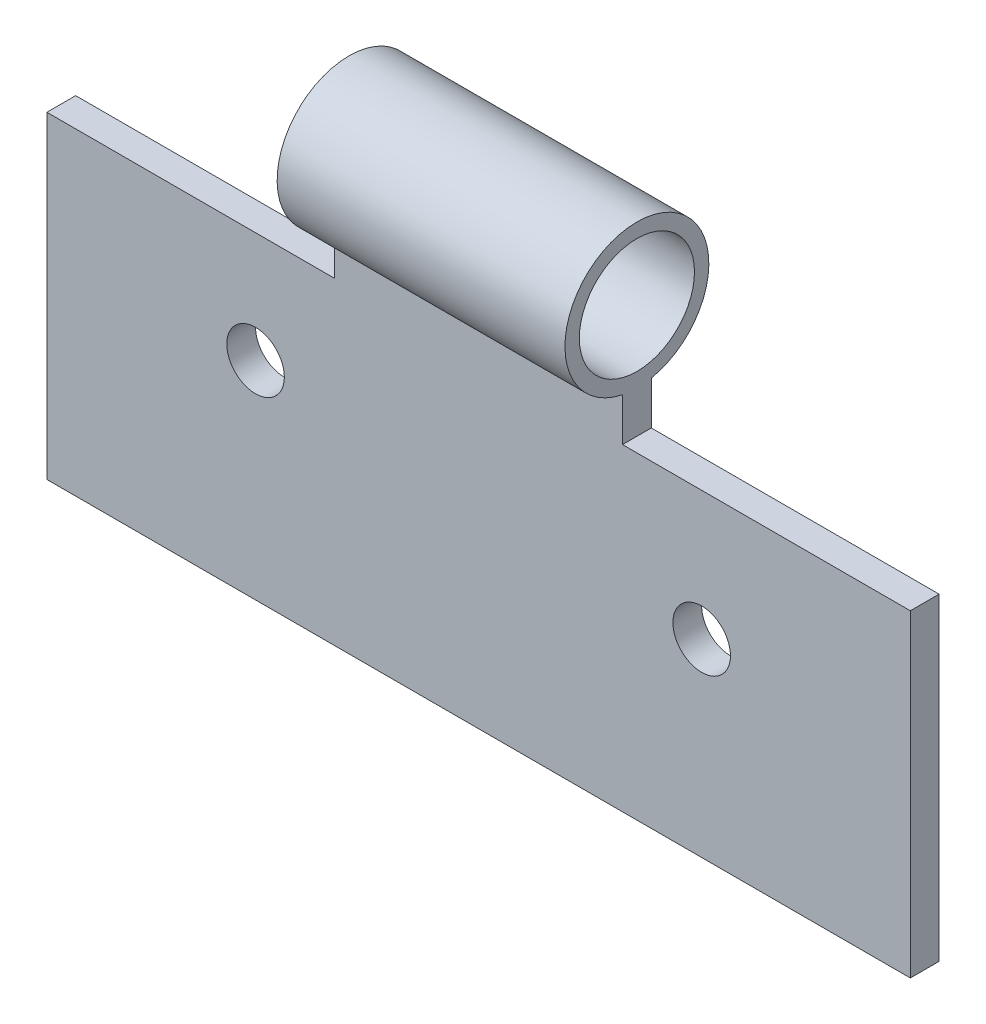
ISO-10303-21;
HEADER;
FILE_DESCRIPTION(('STEP AP214'),'2;1');
FILE_NAME('part.step','',(''),(''),'','','');
FILE_SCHEMA(('AUTOMOTIVE_DESIGN { 1 0 10303 214 1 1 1 1 }'));
ENDSEC;
DATA;
#1=APPLICATION_CONTEXT('core data for automotive mechanical design processes');
#2=APPLICATION_PROTOCOL_DEFINITION('international standard','automotive_design',2000,#1);
#3=PRODUCT_CONTEXT('',#1,'mechanical');
#4=PRODUCT('Part','Part','',(#3));
#5=PRODUCT_RELATED_PRODUCT_CATEGORY('part','',(#4));
#6=PRODUCT_DEFINITION_FORMATION('','',#4);
#7=PRODUCT_DEFINITION_CONTEXT('part definition',#1,'design');
#8=PRODUCT_DEFINITION('design','',#6,#7);
#9=PRODUCT_DEFINITION_SHAPE('','',#8);
#10=(LENGTH_UNIT() NAMED_UNIT(*) SI_UNIT(.MILLI.,.METRE.));
#11=(NAMED_UNIT(*) PLANE_ANGLE_UNIT() SI_UNIT($,.RADIAN.));
#12=(NAMED_UNIT(*) SI_UNIT($,.STERADIAN.) SOLID_ANGLE_UNIT());
#13=UNCERTAINTY_MEASURE_WITH_UNIT(LENGTH_MEASURE(1.E-05),#10,'distance_accuracy_value','');
#14=(GEOMETRIC_REPRESENTATION_CONTEXT(3) GLOBAL_UNCERTAINTY_ASSIGNED_CONTEXT((#13)) GLOBAL_UNIT_ASSIGNED_CONTEXT((#10,
#11,#12)) REPRESENTATION_CONTEXT('',''));
#15=CARTESIAN_POINT('',(0.,0.,0.));
#16=DIRECTION('',(0.,0.,1.));
#17=DIRECTION('',(1.,0.,0.));
#18=AXIS2_PLACEMENT_3D('',#15,#16,#17);
#19=CARTESIAN_POINT('',(3.,-0.75,0.));
#20=DIRECTION('',(0.,0.,-1.));
#21=DIRECTION('',(0.,1.,0.));
#22=AXIS2_PLACEMENT_3D('',#19,#20,#21);
#23=PLANE('',#22);
#24=CARTESIAN_POINT('',(2.275,-0.0928764860805289,0.));
#25=DIRECTION('',(0.,0.,1.));
#26=DIRECTION('',(1.,0.,0.));
#27=AXIS2_PLACEMENT_3D('',#24,#25,#26);
#28=CIRCLE('',#27,0.0999999999999999);
#29=CARTESIAN_POINT('',(2.375,-0.0928764860805289,0.));
#30=VERTEX_POINT('',#29);
#31=EDGE_CURVE('E173',#30,#30,#28,.T.);
#32=ORIENTED_EDGE('',*,*,#31,.F.);
#33=EDGE_LOOP('',(#32));
#34=FACE_BOUND('',#33,.T.);
#35=CARTESIAN_POINT('',(0.725,-0.0295980010586301,0.));
#36=DIRECTION('',(0.,0.,1.));
#37=DIRECTION('',(1.,0.,0.));
#38=AXIS2_PLACEMENT_3D('',#35,#36,#37);
#39=CIRCLE('',#38,0.1);
#40=CARTESIAN_POINT('',(0.825,-0.0295980010586301,0.));
#41=VERTEX_POINT('',#40);
#42=EDGE_CURVE('E166',#41,#41,#39,.T.);
#43=ORIENTED_EDGE('',*,*,#42,.F.);
#44=EDGE_LOOP('',(#43));
#45=FACE_BOUND('',#44,.T.);
#46=DIRECTION('',(0.,1.,0.));
#47=VECTOR('',#46,1.);
#48=CARTESIAN_POINT('',(1.,-0.75,0.));
#49=LINE('',#48,#47);
#50=CARTESIAN_POINT('',(1.,0.355051025721683,0.));
#51=VERTEX_POINT('',#50);
#52=CARTESIAN_POINT('',(1.,0.505051025721682,0.));
#53=VERTEX_POINT('',#52);
#54=EDGE_CURVE('E106',#51,#53,#49,.T.);
#55=ORIENTED_EDGE('',*,*,#54,.F.);
#56=DIRECTION('',(1.,0.,0.));
#57=VECTOR('',#56,1.);
#58=CARTESIAN_POINT('',(3.,0.355051025721683,0.));
#59=LINE('',#58,#57);
#60=CARTESIAN_POINT('',(0.,0.355051025721683,0.));
#61=VERTEX_POINT('',#60);
#62=EDGE_CURVE('E110',#61,#51,#59,.T.);
#63=ORIENTED_EDGE('',*,*,#62,.F.);
#64=DIRECTION('',(0.,-1.,0.));
#65=VECTOR('',#64,1.);
#66=CARTESIAN_POINT('',(0.,-0.75,0.));
#67=LINE('',#66,#65);
#68=CARTESIAN_POINT('',(0.,-0.75,0.));
#69=VERTEX_POINT('',#68);
#70=EDGE_CURVE('E139',#61,#69,#67,.T.);
#71=ORIENTED_EDGE('',*,*,#70,.T.);
#72=DIRECTION('',(-1.,0.,0.));
#73=VECTOR('',#72,1.);
#74=CARTESIAN_POINT('',(3.,-0.75,0.));
#75=LINE('',#74,#73);
#76=CARTESIAN_POINT('',(3.,-0.75,0.));
#77=VERTEX_POINT('',#76);
#78=EDGE_CURVE('E158',#77,#69,#75,.T.);
#79=ORIENTED_EDGE('',*,*,#78,.F.);
#80=DIRECTION('',(0.,-1.,0.));
#81=VECTOR('',#80,1.);
#82=CARTESIAN_POINT('',(3.,-0.75,0.));
#83=LINE('',#82,#81);
#84=CARTESIAN_POINT('',(3.,0.355051025721683,0.));
#85=VERTEX_POINT('',#84);
#86=EDGE_CURVE('E140',#85,#77,#83,.T.);
#87=ORIENTED_EDGE('',*,*,#86,.F.);
#88=DIRECTION('',(1.,0.,0.));
#89=VECTOR('',#88,1.);
#90=CARTESIAN_POINT('',(3.,0.355051025721683,0.));
#91=LINE('',#90,#89);
#92=CARTESIAN_POINT('',(2.,0.355051025721683,0.));
#93=VERTEX_POINT('',#92);
#94=EDGE_CURVE('E137',#93,#85,#91,.T.);
#95=ORIENTED_EDGE('',*,*,#94,.F.);
#96=DIRECTION('',(0.,-1.,0.));
#97=VECTOR('',#96,1.);
#98=CARTESIAN_POINT('',(2.,-0.75,0.));
#99=LINE('',#98,#97);
#100=CARTESIAN_POINT('',(2.,0.505051025721682,0.));
#101=VERTEX_POINT('',#100);
#102=EDGE_CURVE('E135',#101,#93,#99,.T.);
#103=ORIENTED_EDGE('',*,*,#102,.F.);
#104=DIRECTION('',(-1.,0.,0.));
#105=VECTOR('',#104,1.);
#106=CARTESIAN_POINT('',(3.,0.505051025721682,0.));
#107=LINE('',#106,#105);
#108=EDGE_CURVE('E147',#101,#53,#107,.T.);
#109=ORIENTED_EDGE('',*,*,#108,.T.);
#110=EDGE_LOOP('',(#55,#63,#71,#79,#87,#95,#103,#109));
#111=FACE_BOUND('',#110,.T.);
#112=ADVANCED_FACE('F30',(#34,#45,#111),#23,.F.);
#113=CARTESIAN_POINT('',(3.,-0.75,-0.1));
#114=DIRECTION('',(0.,0.,1.));
#115=DIRECTION('',(1.,0.,0.));
#116=AXIS2_PLACEMENT_3D('',#113,#114,#115);
#117=PLANE('',#116);
#118=CARTESIAN_POINT('',(2.275,-0.0928764860805289,-0.1));
#119=DIRECTION('',(0.,0.,1.));
#120=DIRECTION('',(1.,0.,0.));
#121=AXIS2_PLACEMENT_3D('',#118,#119,#120);
#122=CIRCLE('',#121,0.0999999999999999);
#123=CARTESIAN_POINT('',(2.375,-0.0928764860805289,-0.1));
#124=VERTEX_POINT('',#123);
#125=EDGE_CURVE('E33',#124,#124,#122,.T.);
#126=ORIENTED_EDGE('',*,*,#125,.T.);
#127=EDGE_LOOP('',(#126));
#128=FACE_BOUND('',#127,.T.);
#129=CARTESIAN_POINT('',(0.725,-0.0295980010586301,-0.1));
#130=DIRECTION('',(0.,0.,1.));
#131=DIRECTION('',(1.,0.,0.));
#132=AXIS2_PLACEMENT_3D('',#129,#130,#131);
#133=CIRCLE('',#132,0.1);
#134=CARTESIAN_POINT('',(0.825,-0.0295980010586301,-0.1));
#135=VERTEX_POINT('',#134);
#136=EDGE_CURVE('E111',#135,#135,#133,.T.);
#137=ORIENTED_EDGE('',*,*,#136,.T.);
#138=EDGE_LOOP('',(#137));
#139=FACE_BOUND('',#138,.T.);
#140=DIRECTION('',(0.,-1.,0.));
#141=VECTOR('',#140,1.);
#142=CARTESIAN_POINT('',(1.,-0.75,-0.1));
#143=LINE('',#142,#141);
#144=CARTESIAN_POINT('',(1.,0.505051025721682,-0.1));
#145=VERTEX_POINT('',#144);
#146=CARTESIAN_POINT('',(1.,0.355051025721683,-0.1));
#147=VERTEX_POINT('',#146);
#148=EDGE_CURVE('E97',#145,#147,#143,.T.);
#149=ORIENTED_EDGE('',*,*,#148,.F.);
#150=DIRECTION('',(-1.,0.,0.));
#151=VECTOR('',#150,1.);
#152=CARTESIAN_POINT('',(3.,0.505051025721682,-0.1));
#153=LINE('',#152,#151);
#154=CARTESIAN_POINT('',(2.,0.505051025721682,-0.1));
#155=VERTEX_POINT('',#154);
#156=EDGE_CURVE('E154',#155,#145,#153,.T.);
#157=ORIENTED_EDGE('',*,*,#156,.F.);
#158=DIRECTION('',(0.,1.,0.));
#159=VECTOR('',#158,1.);
#160=CARTESIAN_POINT('',(2.,-0.75,-0.1));
#161=LINE('',#160,#159);
#162=CARTESIAN_POINT('',(2.,0.355051025721683,-0.1));
#163=VERTEX_POINT('',#162);
#164=EDGE_CURVE('E53',#163,#155,#161,.T.);
#165=ORIENTED_EDGE('',*,*,#164,.F.);
#166=DIRECTION('',(-1.,0.,0.));
#167=VECTOR('',#166,1.);
#168=CARTESIAN_POINT('',(3.,0.355051025721683,-0.1));
#169=LINE('',#168,#167);
#170=CARTESIAN_POINT('',(3.,0.355051025721683,-0.1));
#171=VERTEX_POINT('',#170);
#172=EDGE_CURVE('E38',#171,#163,#169,.T.);
#173=ORIENTED_EDGE('',*,*,#172,.F.);
#174=DIRECTION('',(0.,1.,0.));
#175=VECTOR('',#174,1.);
#176=CARTESIAN_POINT('',(3.,-0.75,-0.1));
#177=LINE('',#176,#175);
#178=CARTESIAN_POINT('',(3.,-0.75,-0.1));
#179=VERTEX_POINT('',#178);
#180=EDGE_CURVE('E144',#179,#171,#177,.T.);
#181=ORIENTED_EDGE('',*,*,#180,.F.);
#182=DIRECTION('',(-1.,0.,0.));
#183=VECTOR('',#182,1.);
#184=CARTESIAN_POINT('',(3.,-0.75,-0.1));
#185=LINE('',#184,#183);
#186=CARTESIAN_POINT('',(0.,-0.75,-0.1));
#187=VERTEX_POINT('',#186);
#188=EDGE_CURVE('E156',#179,#187,#185,.T.);
#189=ORIENTED_EDGE('',*,*,#188,.T.);
#190=DIRECTION('',(0.,1.,0.));
#191=VECTOR('',#190,1.);
#192=CARTESIAN_POINT('',(0.,-0.75,-0.1));
#193=LINE('',#192,#191);
#194=CARTESIAN_POINT('',(0.,0.355051025721683,-0.1));
#195=VERTEX_POINT('',#194);
#196=EDGE_CURVE('E117',#187,#195,#193,.T.);
#197=ORIENTED_EDGE('',*,*,#196,.T.);
#198=DIRECTION('',(-1.,0.,0.));
#199=VECTOR('',#198,1.);
#200=CARTESIAN_POINT('',(3.,0.355051025721683,-0.1));
#201=LINE('',#200,#199);
#202=EDGE_CURVE('E45',#147,#195,#201,.T.);
#203=ORIENTED_EDGE('',*,*,#202,.F.);
#204=EDGE_LOOP('',(#149,#157,#165,#173,#181,#189,#197,#203));
#205=FACE_BOUND('',#204,.T.);
#206=ADVANCED_FACE('F114',(#128,#139,#205),#117,.F.);
#207=CARTESIAN_POINT('',(3.,0.75,-0.0500000000000001));
#208=DIRECTION('',(-1.,0.,0.));
#209=DIRECTION('',(0.,0.,1.));
#210=AXIS2_PLACEMENT_3D('',#207,#208,#209);
#211=CYLINDRICAL_SURFACE('',#210,0.25);
#212=CARTESIAN_POINT('',(1.,0.75,-0.0500000000000001));
#213=DIRECTION('',(-1.,0.,0.));
#214=DIRECTION('',(0.,0.,1.));
#215=AXIS2_PLACEMENT_3D('',#212,#213,#214);
#216=CIRCLE('',#215,0.25);
#217=EDGE_CURVE('E102',#53,#145,#216,.T.);
#218=ORIENTED_EDGE('',*,*,#217,.F.);
#219=ORIENTED_EDGE('',*,*,#108,.F.);
#220=CARTESIAN_POINT('',(2.,0.75,-0.0500000000000001));
#221=DIRECTION('',(1.,0.,0.));
#222=DIRECTION('',(0.,0.,-1.));
#223=AXIS2_PLACEMENT_3D('',#220,#221,#222);
#224=CIRCLE('',#223,0.25);
#225=EDGE_CURVE('E132',#155,#101,#224,.T.);
#226=ORIENTED_EDGE('',*,*,#225,.F.);
#227=ORIENTED_EDGE('',*,*,#156,.T.);
#228=EDGE_LOOP('',(#218,#219,#226,#227));
#229=FACE_BOUND('',#228,.T.);
#230=ADVANCED_FACE('F188',(#229),#211,.T.);
#231=CARTESIAN_POINT('',(3.,0.75,-0.0500000000000001));
#232=DIRECTION('',(-1.,0.,0.));
#233=DIRECTION('',(0.,0.,1.));
#234=AXIS2_PLACEMENT_3D('',#231,#232,#233);
#235=CYLINDRICAL_SURFACE('',#234,0.2);
#236=CARTESIAN_POINT('',(2.,0.75,-0.0500000000000001));
#237=DIRECTION('',(1.,0.,0.));
#238=DIRECTION('',(0.,0.,-1.));
#239=AXIS2_PLACEMENT_3D('',#236,#237,#238);
#240=CIRCLE('',#239,0.2);
#241=CARTESIAN_POINT('',(2.,0.75,-0.25));
#242=VERTEX_POINT('',#241);
#243=EDGE_CURVE('E131',#242,#242,#240,.T.);
#244=ORIENTED_EDGE('',*,*,#243,.T.);
#245=EDGE_LOOP('',(#244));
#246=FACE_BOUND('',#245,.T.);
#247=CARTESIAN_POINT('',(1.,0.75,-0.0500000000000001));
#248=DIRECTION('',(-1.,0.,0.));
#249=DIRECTION('',(0.,0.,1.));
#250=AXIS2_PLACEMENT_3D('',#247,#248,#249);
#251=CIRCLE('',#250,0.2);
#252=CARTESIAN_POINT('',(1.,0.75,0.15));
#253=VERTEX_POINT('',#252);
#254=EDGE_CURVE('E119',#253,#253,#251,.T.);
#255=ORIENTED_EDGE('',*,*,#254,.T.);
#256=EDGE_LOOP('',(#255));
#257=FACE_BOUND('',#256,.T.);
#258=ADVANCED_FACE('F218',(#246,#257),#235,.F.);
#259=CARTESIAN_POINT('',(0.,0.75,-0.0500000000000001));
#260=DIRECTION('',(1.,0.,0.));
#261=DIRECTION('',(0.,0.,-1.));
#262=AXIS2_PLACEMENT_3D('',#259,#260,#261);
#263=PLANE('',#262);
#264=DIRECTION('',(0.,0.,1.));
#265=VECTOR('',#264,1.);
#266=CARTESIAN_POINT('',(0.,0.355051025721683,-0.0500000000000001));
#267=LINE('',#266,#265);
#268=EDGE_CURVE('E11',#195,#61,#267,.T.);
#269=ORIENTED_EDGE('',*,*,#268,.F.);
#270=ORIENTED_EDGE('',*,*,#196,.F.);
#271=DIRECTION('',(0.,0.,-1.));
#272=VECTOR('',#271,1.);
#273=CARTESIAN_POINT('',(0.,-0.75,0.));
#274=LINE('',#273,#272);
#275=EDGE_CURVE('E149',#69,#187,#274,.T.);
#276=ORIENTED_EDGE('',*,*,#275,.F.);
#277=ORIENTED_EDGE('',*,*,#70,.F.);
#278=EDGE_LOOP('',(#269,#270,#276,#277));
#279=FACE_BOUND('',#278,.T.);
#280=ADVANCED_FACE('F202',(#279),#263,.F.);
#281=CARTESIAN_POINT('',(3.,0.75,-0.0500000000000001));
#282=DIRECTION('',(1.,0.,0.));
#283=DIRECTION('',(0.,0.,-1.));
#284=AXIS2_PLACEMENT_3D('',#281,#282,#283);
#285=PLANE('',#284);
#286=ORIENTED_EDGE('',*,*,#180,.T.);
#287=DIRECTION('',(0.,0.,1.));
#288=VECTOR('',#287,1.);
#289=CARTESIAN_POINT('',(3.,0.355051025721683,-3.1));
#290=LINE('',#289,#288);
#291=EDGE_CURVE('E128',#171,#85,#290,.T.);
#292=ORIENTED_EDGE('',*,*,#291,.T.);
#293=ORIENTED_EDGE('',*,*,#86,.T.);
#294=DIRECTION('',(0.,0.,-1.));
#295=VECTOR('',#294,1.);
#296=CARTESIAN_POINT('',(3.,-0.75,0.));
#297=LINE('',#296,#295);
#298=EDGE_CURVE('E142',#77,#179,#297,.T.);
#299=ORIENTED_EDGE('',*,*,#298,.T.);
#300=EDGE_LOOP('',(#286,#292,#293,#299));
#301=FACE_BOUND('',#300,.T.);
#302=ADVANCED_FACE('F193',(#301),#285,.T.);
#303=CARTESIAN_POINT('',(3.,-0.75,0.));
#304=DIRECTION('',(0.,1.,0.));
#305=DIRECTION('',(0.,0.,1.));
#306=AXIS2_PLACEMENT_3D('',#303,#304,#305);
#307=PLANE('',#306);
#308=ORIENTED_EDGE('',*,*,#275,.T.);
#309=ORIENTED_EDGE('',*,*,#188,.F.);
#310=ORIENTED_EDGE('',*,*,#298,.F.);
#311=ORIENTED_EDGE('',*,*,#78,.T.);
#312=EDGE_LOOP('',(#308,#309,#310,#311));
#313=FACE_BOUND('',#312,.T.);
#314=ADVANCED_FACE('F199',(#313),#307,.F.);
#315=CARTESIAN_POINT('',(2.,0.355051025721683,-3.1));
#316=DIRECTION('',(0.,1.,0.));
#317=DIRECTION('',(0.,0.,1.));
#318=AXIS2_PLACEMENT_3D('',#315,#316,#317);
#319=PLANE('',#318);
#320=ORIENTED_EDGE('',*,*,#94,.T.);
#321=ORIENTED_EDGE('',*,*,#291,.F.);
#322=ORIENTED_EDGE('',*,*,#172,.T.);
#323=DIRECTION('',(0.,0.,1.));
#324=VECTOR('',#323,1.);
#325=CARTESIAN_POINT('',(2.,0.355051025721683,-3.1));
#326=LINE('',#325,#324);
#327=EDGE_CURVE('E125',#163,#93,#326,.T.);
#328=ORIENTED_EDGE('',*,*,#327,.T.);
#329=EDGE_LOOP('',(#320,#321,#322,#328));
#330=FACE_BOUND('',#329,.T.);
#331=ADVANCED_FACE('F204',(#330),#319,.T.);
#332=CARTESIAN_POINT('',(2.,1.82674159455587,-3.1));
#333=DIRECTION('',(1.,0.,0.));
#334=DIRECTION('',(0.,0.,-1.));
#335=AXIS2_PLACEMENT_3D('',#332,#333,#334);
#336=PLANE('',#335);
#337=ORIENTED_EDGE('',*,*,#243,.F.);
#338=EDGE_LOOP('',(#337));
#339=FACE_BOUND('',#338,.T.);
#340=ORIENTED_EDGE('',*,*,#102,.T.);
#341=ORIENTED_EDGE('',*,*,#327,.F.);
#342=ORIENTED_EDGE('',*,*,#164,.T.);
#343=ORIENTED_EDGE('',*,*,#225,.T.);
#344=EDGE_LOOP('',(#340,#341,#342,#343));
#345=FACE_BOUND('',#344,.T.);
#346=ADVANCED_FACE('F205',(#339,#345),#336,.T.);
#347=CARTESIAN_POINT('',(1.,1.82674159455587,-3.1));
#348=DIRECTION('',(-1.,0.,0.));
#349=DIRECTION('',(0.,0.,1.));
#350=AXIS2_PLACEMENT_3D('',#347,#348,#349);
#351=PLANE('',#350);
#352=ORIENTED_EDGE('',*,*,#254,.F.);
#353=EDGE_LOOP('',(#352));
#354=FACE_BOUND('',#353,.T.);
#355=ORIENTED_EDGE('',*,*,#54,.T.);
#356=ORIENTED_EDGE('',*,*,#217,.T.);
#357=ORIENTED_EDGE('',*,*,#148,.T.);
#358=DIRECTION('',(0.,0.,1.));
#359=VECTOR('',#358,1.);
#360=CARTESIAN_POINT('',(1.,0.355051025721683,-3.1));
#361=LINE('',#360,#359);
#362=EDGE_CURVE('E99',#147,#51,#361,.T.);
#363=ORIENTED_EDGE('',*,*,#362,.T.);
#364=EDGE_LOOP('',(#355,#356,#357,#363));
#365=FACE_BOUND('',#364,.T.);
#366=ADVANCED_FACE('F98',(#354,#365),#351,.T.);
#367=CARTESIAN_POINT('',(1.,0.355051025721683,-3.1));
#368=DIRECTION('',(0.,1.,0.));
#369=DIRECTION('',(0.,0.,1.));
#370=AXIS2_PLACEMENT_3D('',#367,#368,#369);
#371=PLANE('',#370);
#372=ORIENTED_EDGE('',*,*,#62,.T.);
#373=ORIENTED_EDGE('',*,*,#362,.F.);
#374=ORIENTED_EDGE('',*,*,#202,.T.);
#375=ORIENTED_EDGE('',*,*,#268,.T.);
#376=EDGE_LOOP('',(#372,#373,#374,#375));
#377=FACE_BOUND('',#376,.T.);
#378=ADVANCED_FACE('F108',(#377),#371,.T.);
#379=CARTESIAN_POINT('',(0.725,-0.0295980010586301,-3.));
#380=DIRECTION('',(0.,0.,1.));
#381=DIRECTION('',(1.,0.,0.));
#382=AXIS2_PLACEMENT_3D('',#379,#380,#381);
#383=CYLINDRICAL_SURFACE('',#382,0.1);
#384=ORIENTED_EDGE('',*,*,#42,.T.);
#385=EDGE_LOOP('',(#384));
#386=FACE_BOUND('',#385,.T.);
#387=ORIENTED_EDGE('',*,*,#136,.F.);
#388=EDGE_LOOP('',(#387));
#389=FACE_BOUND('',#388,.T.);
#390=ADVANCED_FACE('F263',(#386,#389),#383,.F.);
#391=CARTESIAN_POINT('',(2.275,-0.0928764860805289,-3.));
#392=DIRECTION('',(0.,0.,1.));
#393=DIRECTION('',(1.,0.,0.));
#394=AXIS2_PLACEMENT_3D('',#391,#392,#393);
#395=CYLINDRICAL_SURFACE('',#394,0.0999999999999999);
#396=ORIENTED_EDGE('',*,*,#31,.T.);
#397=EDGE_LOOP('',(#396));
#398=FACE_BOUND('',#397,.T.);
#399=ORIENTED_EDGE('',*,*,#125,.F.);
#400=EDGE_LOOP('',(#399));
#401=FACE_BOUND('',#400,.T.);
#402=ADVANCED_FACE('F178',(#398,#401),#395,.F.);
#403=CLOSED_SHELL('',(#112,#206,#230,#258,#280,#302,#314,#331,#346,#366,#378,#390,#402));
#404=MANIFOLD_SOLID_BREP('B2',#403);
#405=ADVANCED_BREP_SHAPE_REPRESENTATION('',(#18,#404),#14);
#406=SHAPE_DEFINITION_REPRESENTATION(#9,#405);
ENDSEC;
END-ISO-10303-21;
